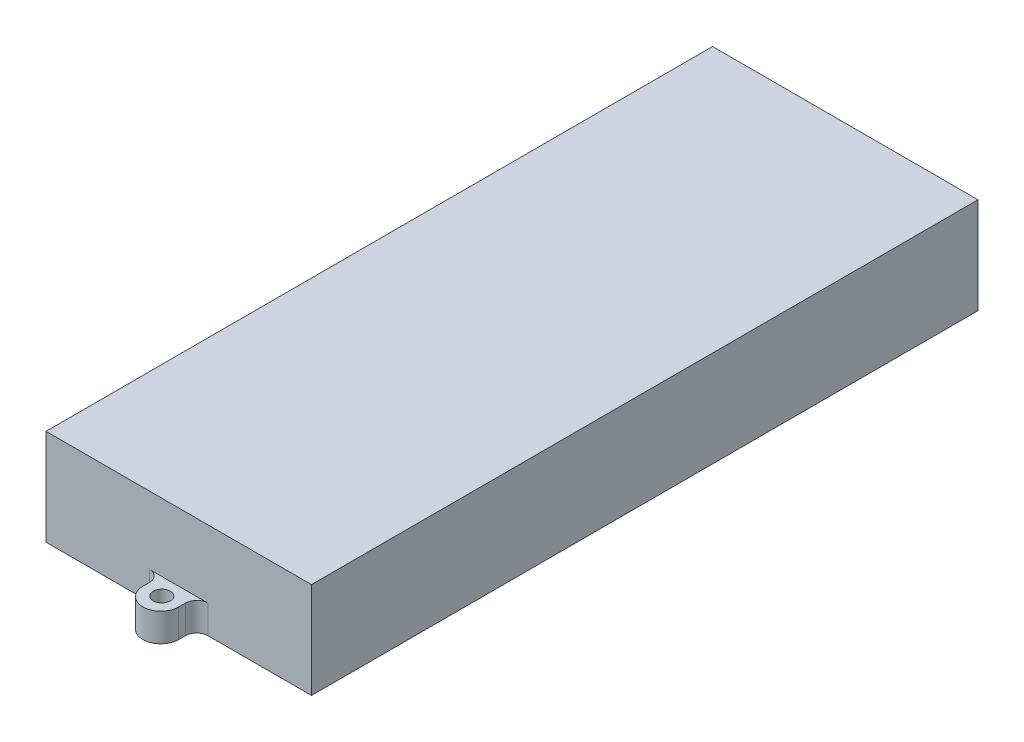
ISO-10303-21;
HEADER;
FILE_DESCRIPTION(('STEP AP214'),'2;1');
FILE_NAME('part.step','',(''),(''),'','','');
FILE_SCHEMA(('AUTOMOTIVE_DESIGN { 1 0 10303 214 1 1 1 1 }'));
ENDSEC;
DATA;
#1=APPLICATION_CONTEXT('core data for automotive mechanical design processes');
#2=APPLICATION_PROTOCOL_DEFINITION('international standard','automotive_design',2000,#1);
#3=PRODUCT_CONTEXT('',#1,'mechanical');
#4=PRODUCT('Part','Part','',(#3));
#5=PRODUCT_RELATED_PRODUCT_CATEGORY('part','',(#4));
#6=PRODUCT_DEFINITION_FORMATION('','',#4);
#7=PRODUCT_DEFINITION_CONTEXT('part definition',#1,'design');
#8=PRODUCT_DEFINITION('design','',#6,#7);
#9=PRODUCT_DEFINITION_SHAPE('','',#8);
#10=(LENGTH_UNIT() NAMED_UNIT(*) SI_UNIT(.MILLI.,.METRE.));
#11=(NAMED_UNIT(*) PLANE_ANGLE_UNIT() SI_UNIT($,.RADIAN.));
#12=(NAMED_UNIT(*) SI_UNIT($,.STERADIAN.) SOLID_ANGLE_UNIT());
#13=UNCERTAINTY_MEASURE_WITH_UNIT(LENGTH_MEASURE(1.E-05),#10,'distance_accuracy_value','');
#14=(GEOMETRIC_REPRESENTATION_CONTEXT(3) GLOBAL_UNCERTAINTY_ASSIGNED_CONTEXT((#13)) GLOBAL_UNIT_ASSIGNED_CONTEXT((#10,
#11,#12)) REPRESENTATION_CONTEXT('',''));
#15=CARTESIAN_POINT('',(0.,0.,0.));
#16=DIRECTION('',(0.,0.,1.));
#17=DIRECTION('',(1.,0.,0.));
#18=AXIS2_PLACEMENT_3D('',#15,#16,#17);
#19=CARTESIAN_POINT('',(-23.5,17.,59.));
#20=DIRECTION('',(0.,0.,-1.));
#21=DIRECTION('',(-1.,0.,0.));
#22=AXIS2_PLACEMENT_3D('',#19,#20,#21);
#23=PLANE('',#22);
#24=DIRECTION('',(1.,0.,0.));
#25=VECTOR('',#24,1.);
#26=CARTESIAN_POINT('',(-23.5,0.,59.));
#27=LINE('',#26,#25);
#28=CARTESIAN_POINT('',(-23.5,0.,59.));
#29=VERTEX_POINT('',#28);
#30=CARTESIAN_POINT('',(-5.175,0.,59.));
#31=VERTEX_POINT('',#30);
#32=EDGE_CURVE('E218',#29,#31,#27,.T.);
#33=ORIENTED_EDGE('',*,*,#32,.T.);
#34=DIRECTION('',(0.,-1.,0.));
#35=VECTOR('',#34,1.);
#36=CARTESIAN_POINT('',(-5.175,5.,59.));
#37=LINE('',#36,#35);
#38=CARTESIAN_POINT('',(-5.175,5.,59.));
#39=VERTEX_POINT('',#38);
#40=EDGE_CURVE('E262',#31,#39,#37,.F.);
#41=ORIENTED_EDGE('',*,*,#40,.T.);
#42=DIRECTION('',(-1.,0.,0.));
#43=VECTOR('',#42,1.);
#44=CARTESIAN_POINT('',(-3.175,5.,59.));
#45=LINE('',#44,#43);
#46=CARTESIAN_POINT('',(5.175,5.,59.));
#47=VERTEX_POINT('',#46);
#48=EDGE_CURVE('E188',#47,#39,#45,.T.);
#49=ORIENTED_EDGE('',*,*,#48,.F.);
#50=DIRECTION('',(0.,-1.,0.));
#51=VECTOR('',#50,1.);
#52=CARTESIAN_POINT('',(5.175,0.,59.));
#53=LINE('',#52,#51);
#54=CARTESIAN_POINT('',(5.175,0.,59.));
#55=VERTEX_POINT('',#54);
#56=EDGE_CURVE('E259',#47,#55,#53,.T.);
#57=ORIENTED_EDGE('',*,*,#56,.T.);
#58=CARTESIAN_POINT('',(23.5,0.,59.));
#59=VERTEX_POINT('',#58);
#60=EDGE_CURVE('E233',#55,#59,#27,.T.);
#61=ORIENTED_EDGE('',*,*,#60,.T.);
#62=DIRECTION('',(0.,-1.,0.));
#63=VECTOR('',#62,1.);
#64=CARTESIAN_POINT('',(23.5,17.,59.));
#65=LINE('',#64,#63);
#66=CARTESIAN_POINT('',(23.5,17.,59.));
#67=VERTEX_POINT('',#66);
#68=EDGE_CURVE('E224',#67,#59,#65,.T.);
#69=ORIENTED_EDGE('',*,*,#68,.F.);
#70=DIRECTION('',(1.,0.,0.));
#71=VECTOR('',#70,1.);
#72=CARTESIAN_POINT('',(-23.5,17.,59.));
#73=LINE('',#72,#71);
#74=CARTESIAN_POINT('',(-23.5,17.,59.));
#75=VERTEX_POINT('',#74);
#76=EDGE_CURVE('E222',#75,#67,#73,.T.);
#77=ORIENTED_EDGE('',*,*,#76,.F.);
#78=DIRECTION('',(0.,-1.,0.));
#79=VECTOR('',#78,1.);
#80=CARTESIAN_POINT('',(-23.5,17.,59.));
#81=LINE('',#80,#79);
#82=EDGE_CURVE('E238',#75,#29,#81,.T.);
#83=ORIENTED_EDGE('',*,*,#82,.T.);
#84=EDGE_LOOP('',(#33,#41,#49,#57,#61,#69,#77,#83));
#85=FACE_BOUND('',#84,.T.);
#86=ADVANCED_FACE('F43',(#85),#23,.F.);
#87=CARTESIAN_POINT('',(-23.5,17.,-59.));
#88=DIRECTION('',(0.,0.,1.));
#89=DIRECTION('',(1.,0.,0.));
#90=AXIS2_PLACEMENT_3D('',#87,#88,#89);
#91=PLANE('',#90);
#92=DIRECTION('',(-1.,0.,0.));
#93=VECTOR('',#92,1.);
#94=CARTESIAN_POINT('',(-23.5,0.,-59.));
#95=LINE('',#94,#93);
#96=CARTESIAN_POINT('',(23.5,0.,-59.));
#97=VERTEX_POINT('',#96);
#98=CARTESIAN_POINT('',(5.175,0.,-59.));
#99=VERTEX_POINT('',#98);
#100=EDGE_CURVE('E228',#97,#99,#95,.T.);
#101=ORIENTED_EDGE('',*,*,#100,.T.);
#102=DIRECTION('',(0.,-1.,0.));
#103=VECTOR('',#102,1.);
#104=CARTESIAN_POINT('',(5.175,5.,-59.));
#105=LINE('',#104,#103);
#106=CARTESIAN_POINT('',(5.175,5.,-59.));
#107=VERTEX_POINT('',#106);
#108=EDGE_CURVE('E253',#99,#107,#105,.F.);
#109=ORIENTED_EDGE('',*,*,#108,.T.);
#110=DIRECTION('',(1.,0.,0.));
#111=VECTOR('',#110,1.);
#112=CARTESIAN_POINT('',(-3.175,5.,-59.));
#113=LINE('',#112,#111);
#114=CARTESIAN_POINT('',(-5.175,5.,-59.));
#115=VERTEX_POINT('',#114);
#116=EDGE_CURVE('E200',#115,#107,#113,.T.);
#117=ORIENTED_EDGE('',*,*,#116,.F.);
#118=DIRECTION('',(0.,-1.,0.));
#119=VECTOR('',#118,1.);
#120=CARTESIAN_POINT('',(-5.175,0.,-59.));
#121=LINE('',#120,#119);
#122=CARTESIAN_POINT('',(-5.175,0.,-59.));
#123=VERTEX_POINT('',#122);
#124=EDGE_CURVE('E250',#115,#123,#121,.T.);
#125=ORIENTED_EDGE('',*,*,#124,.T.);
#126=CARTESIAN_POINT('',(-23.5,0.,-59.));
#127=VERTEX_POINT('',#126);
#128=EDGE_CURVE('E227',#123,#127,#95,.T.);
#129=ORIENTED_EDGE('',*,*,#128,.T.);
#130=DIRECTION('',(0.,-1.,0.));
#131=VECTOR('',#130,1.);
#132=CARTESIAN_POINT('',(-23.5,17.,-59.));
#133=LINE('',#132,#131);
#134=CARTESIAN_POINT('',(-23.5,17.,-59.));
#135=VERTEX_POINT('',#134);
#136=EDGE_CURVE('E241',#135,#127,#133,.T.);
#137=ORIENTED_EDGE('',*,*,#136,.F.);
#138=DIRECTION('',(-1.,0.,0.));
#139=VECTOR('',#138,1.);
#140=CARTESIAN_POINT('',(-23.5,17.,-59.));
#141=LINE('',#140,#139);
#142=CARTESIAN_POINT('',(23.5,17.,-59.));
#143=VERTEX_POINT('',#142);
#144=EDGE_CURVE('E217',#143,#135,#141,.T.);
#145=ORIENTED_EDGE('',*,*,#144,.F.);
#146=DIRECTION('',(0.,-1.,0.));
#147=VECTOR('',#146,1.);
#148=CARTESIAN_POINT('',(23.5,17.,-59.));
#149=LINE('',#148,#147);
#150=EDGE_CURVE('E244',#143,#97,#149,.T.);
#151=ORIENTED_EDGE('',*,*,#150,.T.);
#152=EDGE_LOOP('',(#101,#109,#117,#125,#129,#137,#145,#151));
#153=FACE_BOUND('',#152,.T.);
#154=ADVANCED_FACE('F296',(#153),#91,.F.);
#155=CARTESIAN_POINT('',(23.5,17.,59.));
#156=DIRECTION('',(-1.,0.,0.));
#157=DIRECTION('',(0.,0.,1.));
#158=AXIS2_PLACEMENT_3D('',#155,#156,#157);
#159=PLANE('',#158);
#160=DIRECTION('',(0.,0.,-1.));
#161=VECTOR('',#160,1.);
#162=CARTESIAN_POINT('',(23.5,0.,59.));
#163=LINE('',#162,#161);
#164=EDGE_CURVE('E213',#59,#97,#163,.T.);
#165=ORIENTED_EDGE('',*,*,#164,.T.);
#166=ORIENTED_EDGE('',*,*,#150,.F.);
#167=DIRECTION('',(0.,0.,-1.));
#168=VECTOR('',#167,1.);
#169=CARTESIAN_POINT('',(23.5,17.,59.));
#170=LINE('',#169,#168);
#171=EDGE_CURVE('E214',#67,#143,#170,.T.);
#172=ORIENTED_EDGE('',*,*,#171,.F.);
#173=ORIENTED_EDGE('',*,*,#68,.T.);
#174=EDGE_LOOP('',(#165,#166,#172,#173));
#175=FACE_BOUND('',#174,.T.);
#176=ADVANCED_FACE('F323',(#175),#159,.F.);
#177=CARTESIAN_POINT('',(-23.5,17.,59.));
#178=DIRECTION('',(1.,0.,0.));
#179=DIRECTION('',(0.,0.,-1.));
#180=AXIS2_PLACEMENT_3D('',#177,#178,#179);
#181=PLANE('',#180);
#182=DIRECTION('',(0.,0.,1.));
#183=VECTOR('',#182,1.);
#184=CARTESIAN_POINT('',(-23.5,0.,59.));
#185=LINE('',#184,#183);
#186=EDGE_CURVE('E231',#127,#29,#185,.T.);
#187=ORIENTED_EDGE('',*,*,#186,.T.);
#188=ORIENTED_EDGE('',*,*,#82,.F.);
#189=DIRECTION('',(0.,0.,1.));
#190=VECTOR('',#189,1.);
#191=CARTESIAN_POINT('',(-23.5,17.,59.));
#192=LINE('',#191,#190);
#193=EDGE_CURVE('E220',#135,#75,#192,.T.);
#194=ORIENTED_EDGE('',*,*,#193,.F.);
#195=ORIENTED_EDGE('',*,*,#136,.T.);
#196=EDGE_LOOP('',(#187,#188,#194,#195));
#197=FACE_BOUND('',#196,.T.);
#198=ADVANCED_FACE('F292',(#197),#181,.F.);
#199=CARTESIAN_POINT('',(0.,17.,0.));
#200=DIRECTION('',(0.,-1.,0.));
#201=DIRECTION('',(0.,0.,-1.));
#202=AXIS2_PLACEMENT_3D('',#199,#200,#201);
#203=PLANE('',#202);
#204=ORIENTED_EDGE('',*,*,#171,.T.);
#205=ORIENTED_EDGE('',*,*,#144,.T.);
#206=ORIENTED_EDGE('',*,*,#193,.T.);
#207=ORIENTED_EDGE('',*,*,#76,.T.);
#208=EDGE_LOOP('',(#204,#205,#206,#207));
#209=FACE_BOUND('',#208,.T.);
#210=ADVANCED_FACE('F369',(#209),#203,.F.);
#211=CARTESIAN_POINT('',(0.,0.,0.));
#212=DIRECTION('',(0.,-1.,0.));
#213=DIRECTION('',(0.,0.,-1.));
#214=AXIS2_PLACEMENT_3D('',#211,#212,#213);
#215=PLANE('',#214);
#216=CARTESIAN_POINT('',(0.,0.,62.));
#217=DIRECTION('',(0.,1.,0.));
#218=DIRECTION('',(0.,0.,1.));
#219=AXIS2_PLACEMENT_3D('',#216,#217,#218);
#220=CIRCLE('',#219,1.5);
#221=CARTESIAN_POINT('',(0.,0.,63.5));
#222=VERTEX_POINT('',#221);
#223=EDGE_CURVE('E329',#222,#222,#220,.T.);
#224=ORIENTED_EDGE('',*,*,#223,.T.);
#225=EDGE_LOOP('',(#224));
#226=FACE_BOUND('',#225,.T.);
#227=CARTESIAN_POINT('',(0.,0.,-62.));
#228=DIRECTION('',(0.,1.,0.));
#229=DIRECTION('',(0.,0.,1.));
#230=AXIS2_PLACEMENT_3D('',#227,#228,#229);
#231=CIRCLE('',#230,1.5);
#232=CARTESIAN_POINT('',(0.,0.,-60.5));
#233=VERTEX_POINT('',#232);
#234=EDGE_CURVE('E335',#233,#233,#231,.T.);
#235=ORIENTED_EDGE('',*,*,#234,.T.);
#236=EDGE_LOOP('',(#235));
#237=FACE_BOUND('',#236,.T.);
#238=ORIENTED_EDGE('',*,*,#164,.F.);
#239=ORIENTED_EDGE('',*,*,#60,.F.);
#240=CARTESIAN_POINT('',(5.175,0.,61.));
#241=DIRECTION('',(0.,-1.,0.));
#242=DIRECTION('',(0.,0.,-1.));
#243=AXIS2_PLACEMENT_3D('',#240,#241,#242);
#244=CIRCLE('',#243,2.);
#245=CARTESIAN_POINT('',(3.175,0.,61.));
#246=VERTEX_POINT('',#245);
#247=EDGE_CURVE('E51',#55,#246,#244,.F.);
#248=ORIENTED_EDGE('',*,*,#247,.T.);
#249=DIRECTION('',(0.,0.,-1.));
#250=VECTOR('',#249,1.);
#251=CARTESIAN_POINT('',(3.175,0.,62.175));
#252=LINE('',#251,#250);
#253=CARTESIAN_POINT('',(3.175,0.,62.175));
#254=VERTEX_POINT('',#253);
#255=EDGE_CURVE('E165',#254,#246,#252,.T.);
#256=ORIENTED_EDGE('',*,*,#255,.F.);
#257=CARTESIAN_POINT('',(0.,0.,62.175));
#258=DIRECTION('',(0.,1.,0.));
#259=DIRECTION('',(0.,0.,-1.));
#260=AXIS2_PLACEMENT_3D('',#257,#258,#259);
#261=CIRCLE('',#260,3.175);
#262=CARTESIAN_POINT('',(-3.175,0.,62.175));
#263=VERTEX_POINT('',#262);
#264=EDGE_CURVE('E172',#263,#254,#261,.T.);
#265=ORIENTED_EDGE('',*,*,#264,.F.);
#266=DIRECTION('',(0.,0.,1.));
#267=VECTOR('',#266,1.);
#268=CARTESIAN_POINT('',(-3.175,0.,62.175));
#269=LINE('',#268,#267);
#270=CARTESIAN_POINT('',(-3.175,0.,61.));
#271=VERTEX_POINT('',#270);
#272=EDGE_CURVE('E156',#271,#263,#269,.T.);
#273=ORIENTED_EDGE('',*,*,#272,.F.);
#274=CARTESIAN_POINT('',(-5.175,0.,61.));
#275=DIRECTION('',(0.,-1.,0.));
#276=DIRECTION('',(0.,0.,-1.));
#277=AXIS2_PLACEMENT_3D('',#274,#275,#276);
#278=CIRCLE('',#277,2.);
#279=EDGE_CURVE('E275',#271,#31,#278,.F.);
#280=ORIENTED_EDGE('',*,*,#279,.T.);
#281=ORIENTED_EDGE('',*,*,#32,.F.);
#282=ORIENTED_EDGE('',*,*,#186,.F.);
#283=ORIENTED_EDGE('',*,*,#128,.F.);
#284=CARTESIAN_POINT('',(-5.175,0.,-61.));
#285=DIRECTION('',(0.,-1.,0.));
#286=DIRECTION('',(0.,0.,-1.));
#287=AXIS2_PLACEMENT_3D('',#284,#285,#286);
#288=CIRCLE('',#287,2.);
#289=CARTESIAN_POINT('',(-3.175,0.,-61.));
#290=VERTEX_POINT('',#289);
#291=EDGE_CURVE('E270',#123,#290,#288,.F.);
#292=ORIENTED_EDGE('',*,*,#291,.T.);
#293=DIRECTION('',(0.,0.,1.));
#294=VECTOR('',#293,1.);
#295=CARTESIAN_POINT('',(-3.175,0.,-62.175));
#296=LINE('',#295,#294);
#297=CARTESIAN_POINT('',(-3.175,0.,-62.175));
#298=VERTEX_POINT('',#297);
#299=EDGE_CURVE('E183',#298,#290,#296,.T.);
#300=ORIENTED_EDGE('',*,*,#299,.F.);
#301=CARTESIAN_POINT('',(0.,0.,-62.175));
#302=DIRECTION('',(0.,1.,0.));
#303=DIRECTION('',(0.,0.,1.));
#304=AXIS2_PLACEMENT_3D('',#301,#302,#303);
#305=CIRCLE('',#304,3.175);
#306=CARTESIAN_POINT('',(3.175,0.,-62.175));
#307=VERTEX_POINT('',#306);
#308=EDGE_CURVE('E180',#307,#298,#305,.T.);
#309=ORIENTED_EDGE('',*,*,#308,.F.);
#310=DIRECTION('',(0.,0.,-1.));
#311=VECTOR('',#310,1.);
#312=CARTESIAN_POINT('',(3.175,0.,-62.175));
#313=LINE('',#312,#311);
#314=CARTESIAN_POINT('',(3.175,0.,-61.));
#315=VERTEX_POINT('',#314);
#316=EDGE_CURVE('E197',#315,#307,#313,.T.);
#317=ORIENTED_EDGE('',*,*,#316,.F.);
#318=CARTESIAN_POINT('',(5.175,0.,-61.));
#319=DIRECTION('',(0.,-1.,0.));
#320=DIRECTION('',(0.,0.,-1.));
#321=AXIS2_PLACEMENT_3D('',#318,#319,#320);
#322=CIRCLE('',#321,2.);
#323=EDGE_CURVE('E266',#315,#99,#322,.F.);
#324=ORIENTED_EDGE('',*,*,#323,.T.);
#325=ORIENTED_EDGE('',*,*,#100,.F.);
#326=EDGE_LOOP('',(#238,#239,#248,#256,#265,#273,#280,#281,#282,#283,#292,#300,#309,#317,#324,#325));
#327=FACE_BOUND('',#326,.T.);
#328=ADVANCED_FACE('F178',(#226,#237,#327),#215,.T.);
#329=CARTESIAN_POINT('',(0.,5.,-62.175));
#330=DIRECTION('',(0.,-1.,0.));
#331=DIRECTION('',(0.,0.,-1.));
#332=AXIS2_PLACEMENT_3D('',#329,#330,#331);
#333=CYLINDRICAL_SURFACE('',#332,3.175);
#334=ORIENTED_EDGE('',*,*,#308,.T.);
#335=DIRECTION('',(0.,-1.,0.));
#336=VECTOR('',#335,1.);
#337=CARTESIAN_POINT('',(-3.175,5.,-62.175));
#338=LINE('',#337,#336);
#339=CARTESIAN_POINT('',(-3.175,5.,-62.175));
#340=VERTEX_POINT('',#339);
#341=EDGE_CURVE('E210',#340,#298,#338,.T.);
#342=ORIENTED_EDGE('',*,*,#341,.F.);
#343=CARTESIAN_POINT('',(0.,5.,-62.175));
#344=DIRECTION('',(0.,1.,0.));
#345=DIRECTION('',(0.,0.,1.));
#346=AXIS2_PLACEMENT_3D('',#343,#344,#345);
#347=CIRCLE('',#346,3.175);
#348=CARTESIAN_POINT('',(3.175,5.,-62.175));
#349=VERTEX_POINT('',#348);
#350=EDGE_CURVE('E193',#349,#340,#347,.T.);
#351=ORIENTED_EDGE('',*,*,#350,.F.);
#352=DIRECTION('',(0.,-1.,0.));
#353=VECTOR('',#352,1.);
#354=CARTESIAN_POINT('',(3.175,5.,-62.175));
#355=LINE('',#354,#353);
#356=EDGE_CURVE('E203',#349,#307,#355,.T.);
#357=ORIENTED_EDGE('',*,*,#356,.T.);
#358=EDGE_LOOP('',(#334,#342,#351,#357));
#359=FACE_BOUND('',#358,.T.);
#360=ADVANCED_FACE('F311',(#359),#333,.T.);
#361=CARTESIAN_POINT('',(-3.175,5.,-62.175));
#362=DIRECTION('',(1.,0.,0.));
#363=DIRECTION('',(0.,0.,-1.));
#364=AXIS2_PLACEMENT_3D('',#361,#362,#363);
#365=PLANE('',#364);
#366=ORIENTED_EDGE('',*,*,#299,.T.);
#367=DIRECTION('',(0.,-1.,0.));
#368=VECTOR('',#367,1.);
#369=CARTESIAN_POINT('',(-3.175,5.,-61.));
#370=LINE('',#369,#368);
#371=CARTESIAN_POINT('',(-3.175,5.,-61.));
#372=VERTEX_POINT('',#371);
#373=EDGE_CURVE('E256',#290,#372,#370,.F.);
#374=ORIENTED_EDGE('',*,*,#373,.T.);
#375=DIRECTION('',(0.,0.,1.));
#376=VECTOR('',#375,1.);
#377=CARTESIAN_POINT('',(-3.175,5.,-62.175));
#378=LINE('',#377,#376);
#379=EDGE_CURVE('E196',#340,#372,#378,.T.);
#380=ORIENTED_EDGE('',*,*,#379,.F.);
#381=ORIENTED_EDGE('',*,*,#341,.T.);
#382=EDGE_LOOP('',(#366,#374,#380,#381));
#383=FACE_BOUND('',#382,.T.);
#384=ADVANCED_FACE('F303',(#383),#365,.F.);
#385=CARTESIAN_POINT('',(3.175,5.,-62.175));
#386=DIRECTION('',(-1.,0.,0.));
#387=DIRECTION('',(0.,0.,1.));
#388=AXIS2_PLACEMENT_3D('',#385,#386,#387);
#389=PLANE('',#388);
#390=DIRECTION('',(0.,0.,-1.));
#391=VECTOR('',#390,1.);
#392=CARTESIAN_POINT('',(3.175,5.,-62.175));
#393=LINE('',#392,#391);
#394=CARTESIAN_POINT('',(3.175,5.,-61.));
#395=VERTEX_POINT('',#394);
#396=EDGE_CURVE('E202',#395,#349,#393,.T.);
#397=ORIENTED_EDGE('',*,*,#396,.F.);
#398=DIRECTION('',(0.,-1.,0.));
#399=VECTOR('',#398,1.);
#400=CARTESIAN_POINT('',(3.175,0.,-61.));
#401=LINE('',#400,#399);
#402=EDGE_CURVE('E247',#395,#315,#401,.T.);
#403=ORIENTED_EDGE('',*,*,#402,.T.);
#404=ORIENTED_EDGE('',*,*,#316,.T.);
#405=ORIENTED_EDGE('',*,*,#356,.F.);
#406=EDGE_LOOP('',(#397,#403,#404,#405));
#407=FACE_BOUND('',#406,.T.);
#408=ADVANCED_FACE('F315',(#407),#389,.F.);
#409=CARTESIAN_POINT('',(0.,5.,-62.175));
#410=DIRECTION('',(0.,1.,0.));
#411=DIRECTION('',(0.,0.,1.));
#412=AXIS2_PLACEMENT_3D('',#409,#410,#411);
#413=PLANE('',#412);
#414=CARTESIAN_POINT('',(0.,5.,-62.));
#415=DIRECTION('',(0.,1.,0.));
#416=DIRECTION('',(0.,0.,1.));
#417=AXIS2_PLACEMENT_3D('',#414,#415,#416);
#418=CIRCLE('',#417,1.5);
#419=CARTESIAN_POINT('',(0.,5.,-60.5));
#420=VERTEX_POINT('',#419);
#421=EDGE_CURVE('E338',#420,#420,#418,.T.);
#422=ORIENTED_EDGE('',*,*,#421,.F.);
#423=EDGE_LOOP('',(#422));
#424=FACE_BOUND('',#423,.T.);
#425=ORIENTED_EDGE('',*,*,#350,.T.);
#426=ORIENTED_EDGE('',*,*,#379,.T.);
#427=CARTESIAN_POINT('',(-5.175,5.,-61.));
#428=DIRECTION('',(0.,1.,0.));
#429=DIRECTION('',(0.,0.,1.));
#430=AXIS2_PLACEMENT_3D('',#427,#428,#429);
#431=CIRCLE('',#430,2.);
#432=EDGE_CURVE('E272',#372,#115,#431,.F.);
#433=ORIENTED_EDGE('',*,*,#432,.T.);
#434=ORIENTED_EDGE('',*,*,#116,.T.);
#435=CARTESIAN_POINT('',(5.175,5.,-61.));
#436=DIRECTION('',(0.,1.,0.));
#437=DIRECTION('',(0.,0.,1.));
#438=AXIS2_PLACEMENT_3D('',#435,#436,#437);
#439=CIRCLE('',#438,2.);
#440=EDGE_CURVE('E268',#107,#395,#439,.F.);
#441=ORIENTED_EDGE('',*,*,#440,.T.);
#442=ORIENTED_EDGE('',*,*,#396,.T.);
#443=EDGE_LOOP('',(#425,#426,#433,#434,#441,#442));
#444=FACE_BOUND('',#443,.T.);
#445=ADVANCED_FACE('F305',(#424,#444),#413,.T.);
#446=CARTESIAN_POINT('',(0.,5.,62.175));
#447=DIRECTION('',(0.,-1.,0.));
#448=DIRECTION('',(0.,0.,-1.));
#449=AXIS2_PLACEMENT_3D('',#446,#447,#448);
#450=CYLINDRICAL_SURFACE('',#449,3.175);
#451=ORIENTED_EDGE('',*,*,#264,.T.);
#452=DIRECTION('',(0.,-1.,0.));
#453=VECTOR('',#452,1.);
#454=CARTESIAN_POINT('',(3.175,5.,62.175));
#455=LINE('',#454,#453);
#456=CARTESIAN_POINT('',(3.175,5.,62.175));
#457=VERTEX_POINT('',#456);
#458=EDGE_CURVE('E175',#457,#254,#455,.T.);
#459=ORIENTED_EDGE('',*,*,#458,.F.);
#460=CARTESIAN_POINT('',(0.,5.,62.175));
#461=DIRECTION('',(0.,1.,0.));
#462=DIRECTION('',(0.,0.,-1.));
#463=AXIS2_PLACEMENT_3D('',#460,#461,#462);
#464=CIRCLE('',#463,3.175);
#465=CARTESIAN_POINT('',(-3.175,5.,62.175));
#466=VERTEX_POINT('',#465);
#467=EDGE_CURVE('E166',#466,#457,#464,.T.);
#468=ORIENTED_EDGE('',*,*,#467,.F.);
#469=DIRECTION('',(0.,-1.,0.));
#470=VECTOR('',#469,1.);
#471=CARTESIAN_POINT('',(-3.175,5.,62.175));
#472=LINE('',#471,#470);
#473=EDGE_CURVE('E160',#466,#263,#472,.T.);
#474=ORIENTED_EDGE('',*,*,#473,.T.);
#475=EDGE_LOOP('',(#451,#459,#468,#474));
#476=FACE_BOUND('',#475,.T.);
#477=ADVANCED_FACE('F170',(#476),#450,.T.);
#478=CARTESIAN_POINT('',(3.175,5.,62.175));
#479=DIRECTION('',(-1.,0.,0.));
#480=DIRECTION('',(0.,0.,1.));
#481=AXIS2_PLACEMENT_3D('',#478,#479,#480);
#482=PLANE('',#481);
#483=ORIENTED_EDGE('',*,*,#255,.T.);
#484=DIRECTION('',(0.,-1.,0.));
#485=VECTOR('',#484,1.);
#486=CARTESIAN_POINT('',(3.175,5.,61.));
#487=LINE('',#486,#485);
#488=CARTESIAN_POINT('',(3.175,5.,61.));
#489=VERTEX_POINT('',#488);
#490=EDGE_CURVE('E58',#246,#489,#487,.F.);
#491=ORIENTED_EDGE('',*,*,#490,.T.);
#492=DIRECTION('',(0.,0.,-1.));
#493=VECTOR('',#492,1.);
#494=CARTESIAN_POINT('',(3.175,5.,62.175));
#495=LINE('',#494,#493);
#496=EDGE_CURVE('E190',#457,#489,#495,.T.);
#497=ORIENTED_EDGE('',*,*,#496,.F.);
#498=ORIENTED_EDGE('',*,*,#458,.T.);
#499=EDGE_LOOP('',(#483,#491,#497,#498));
#500=FACE_BOUND('',#499,.T.);
#501=ADVANCED_FACE('F328',(#500),#482,.F.);
#502=CARTESIAN_POINT('',(-3.175,5.,62.175));
#503=DIRECTION('',(1.,0.,0.));
#504=DIRECTION('',(0.,0.,-1.));
#505=AXIS2_PLACEMENT_3D('',#502,#503,#504);
#506=PLANE('',#505);
#507=DIRECTION('',(0.,0.,1.));
#508=VECTOR('',#507,1.);
#509=CARTESIAN_POINT('',(-3.175,5.,62.175));
#510=LINE('',#509,#508);
#511=CARTESIAN_POINT('',(-3.175,5.,61.));
#512=VERTEX_POINT('',#511);
#513=EDGE_CURVE('E174',#512,#466,#510,.T.);
#514=ORIENTED_EDGE('',*,*,#513,.F.);
#515=DIRECTION('',(0.,-1.,0.));
#516=VECTOR('',#515,1.);
#517=CARTESIAN_POINT('',(-3.175,0.,61.));
#518=LINE('',#517,#516);
#519=EDGE_CURVE('E163',#512,#271,#518,.T.);
#520=ORIENTED_EDGE('',*,*,#519,.T.);
#521=ORIENTED_EDGE('',*,*,#272,.T.);
#522=ORIENTED_EDGE('',*,*,#473,.F.);
#523=EDGE_LOOP('',(#514,#520,#521,#522));
#524=FACE_BOUND('',#523,.T.);
#525=ADVANCED_FACE('F159',(#524),#506,.F.);
#526=CARTESIAN_POINT('',(0.,5.,62.175));
#527=DIRECTION('',(0.,-1.,0.));
#528=DIRECTION('',(0.,0.,-1.));
#529=AXIS2_PLACEMENT_3D('',#526,#527,#528);
#530=PLANE('',#529);
#531=CARTESIAN_POINT('',(0.,5.,62.));
#532=DIRECTION('',(0.,1.,0.));
#533=DIRECTION('',(0.,0.,1.));
#534=AXIS2_PLACEMENT_3D('',#531,#532,#533);
#535=CIRCLE('',#534,1.5);
#536=CARTESIAN_POINT('',(0.,5.,63.5));
#537=VERTEX_POINT('',#536);
#538=EDGE_CURVE('E332',#537,#537,#535,.T.);
#539=ORIENTED_EDGE('',*,*,#538,.F.);
#540=EDGE_LOOP('',(#539));
#541=FACE_BOUND('',#540,.T.);
#542=ORIENTED_EDGE('',*,*,#467,.T.);
#543=ORIENTED_EDGE('',*,*,#496,.T.);
#544=CARTESIAN_POINT('',(5.175,5.,61.));
#545=DIRECTION('',(0.,-1.,0.));
#546=DIRECTION('',(0.,0.,-1.));
#547=AXIS2_PLACEMENT_3D('',#544,#545,#546);
#548=CIRCLE('',#547,2.);
#549=EDGE_CURVE('E11',#489,#47,#548,.T.);
#550=ORIENTED_EDGE('',*,*,#549,.T.);
#551=ORIENTED_EDGE('',*,*,#48,.T.);
#552=CARTESIAN_POINT('',(-5.175,5.,61.));
#553=DIRECTION('',(0.,-1.,0.));
#554=DIRECTION('',(0.,0.,-1.));
#555=AXIS2_PLACEMENT_3D('',#552,#553,#554);
#556=CIRCLE('',#555,2.);
#557=EDGE_CURVE('E277',#39,#512,#556,.T.);
#558=ORIENTED_EDGE('',*,*,#557,.T.);
#559=ORIENTED_EDGE('',*,*,#513,.T.);
#560=EDGE_LOOP('',(#542,#543,#550,#551,#558,#559));
#561=FACE_BOUND('',#560,.T.);
#562=ADVANCED_FACE('F280',(#541,#561),#530,.F.);
#563=CARTESIAN_POINT('',(0.,0.,62.));
#564=DIRECTION('',(0.,1.,0.));
#565=DIRECTION('',(0.,0.,1.));
#566=AXIS2_PLACEMENT_3D('',#563,#564,#565);
#567=CYLINDRICAL_SURFACE('',#566,1.5);
#568=ORIENTED_EDGE('',*,*,#223,.F.);
#569=EDGE_LOOP('',(#568));
#570=FACE_BOUND('',#569,.T.);
#571=ORIENTED_EDGE('',*,*,#538,.T.);
#572=EDGE_LOOP('',(#571));
#573=FACE_BOUND('',#572,.T.);
#574=ADVANCED_FACE('F344',(#570,#573),#567,.F.);
#575=CARTESIAN_POINT('',(0.,0.,-62.));
#576=DIRECTION('',(0.,1.,0.));
#577=DIRECTION('',(0.,0.,1.));
#578=AXIS2_PLACEMENT_3D('',#575,#576,#577);
#579=CYLINDRICAL_SURFACE('',#578,1.5);
#580=ORIENTED_EDGE('',*,*,#234,.F.);
#581=EDGE_LOOP('',(#580));
#582=FACE_BOUND('',#581,.T.);
#583=ORIENTED_EDGE('',*,*,#421,.T.);
#584=EDGE_LOOP('',(#583));
#585=FACE_BOUND('',#584,.T.);
#586=ADVANCED_FACE('F353',(#582,#585),#579,.F.);
#587=CARTESIAN_POINT('',(5.175,5.,-61.));
#588=DIRECTION('',(0.,1.,0.));
#589=DIRECTION('',(0.,0.,1.));
#590=AXIS2_PLACEMENT_3D('',#587,#588,#589);
#591=CYLINDRICAL_SURFACE('',#590,2.);
#592=ORIENTED_EDGE('',*,*,#440,.F.);
#593=ORIENTED_EDGE('',*,*,#108,.F.);
#594=ORIENTED_EDGE('',*,*,#323,.F.);
#595=ORIENTED_EDGE('',*,*,#402,.F.);
#596=EDGE_LOOP('',(#592,#593,#594,#595));
#597=FACE_BOUND('',#596,.T.);
#598=ADVANCED_FACE('F319',(#597),#591,.F.);
#599=CARTESIAN_POINT('',(-5.175,17.,-61.));
#600=DIRECTION('',(0.,1.,0.));
#601=DIRECTION('',(0.,0.,1.));
#602=AXIS2_PLACEMENT_3D('',#599,#600,#601);
#603=CYLINDRICAL_SURFACE('',#602,2.);
#604=ORIENTED_EDGE('',*,*,#432,.F.);
#605=ORIENTED_EDGE('',*,*,#373,.F.);
#606=ORIENTED_EDGE('',*,*,#291,.F.);
#607=ORIENTED_EDGE('',*,*,#124,.F.);
#608=EDGE_LOOP('',(#604,#605,#606,#607));
#609=FACE_BOUND('',#608,.T.);
#610=ADVANCED_FACE('F300',(#609),#603,.F.);
#611=CARTESIAN_POINT('',(-5.175,5.,61.));
#612=DIRECTION('',(0.,1.,0.));
#613=DIRECTION('',(0.,0.,1.));
#614=AXIS2_PLACEMENT_3D('',#611,#612,#613);
#615=CYLINDRICAL_SURFACE('',#614,2.);
#616=ORIENTED_EDGE('',*,*,#557,.F.);
#617=ORIENTED_EDGE('',*,*,#40,.F.);
#618=ORIENTED_EDGE('',*,*,#279,.F.);
#619=ORIENTED_EDGE('',*,*,#519,.F.);
#620=EDGE_LOOP('',(#616,#617,#618,#619));
#621=FACE_BOUND('',#620,.T.);
#622=ADVANCED_FACE('F283',(#621),#615,.F.);
#623=CARTESIAN_POINT('',(5.175,17.,61.));
#624=DIRECTION('',(0.,1.,0.));
#625=DIRECTION('',(0.,0.,1.));
#626=AXIS2_PLACEMENT_3D('',#623,#624,#625);
#627=CYLINDRICAL_SURFACE('',#626,2.);
#628=ORIENTED_EDGE('',*,*,#549,.F.);
#629=ORIENTED_EDGE('',*,*,#490,.F.);
#630=ORIENTED_EDGE('',*,*,#247,.F.);
#631=ORIENTED_EDGE('',*,*,#56,.F.);
#632=EDGE_LOOP('',(#628,#629,#630,#631));
#633=FACE_BOUND('',#632,.T.);
#634=ADVANCED_FACE('F45',(#633),#627,.F.);
#635=CLOSED_SHELL('',(#86,#154,#176,#198,#210,#328,#360,#384,#408,#445,#477,#501,#525,#562,#574,
#586,#598,#610,#622,#634));
#636=MANIFOLD_SOLID_BREP('B2',#635);
#637=ADVANCED_BREP_SHAPE_REPRESENTATION('',(#18,#636),#14);
#638=SHAPE_DEFINITION_REPRESENTATION(#9,#637);
ENDSEC;
END-ISO-10303-21;
